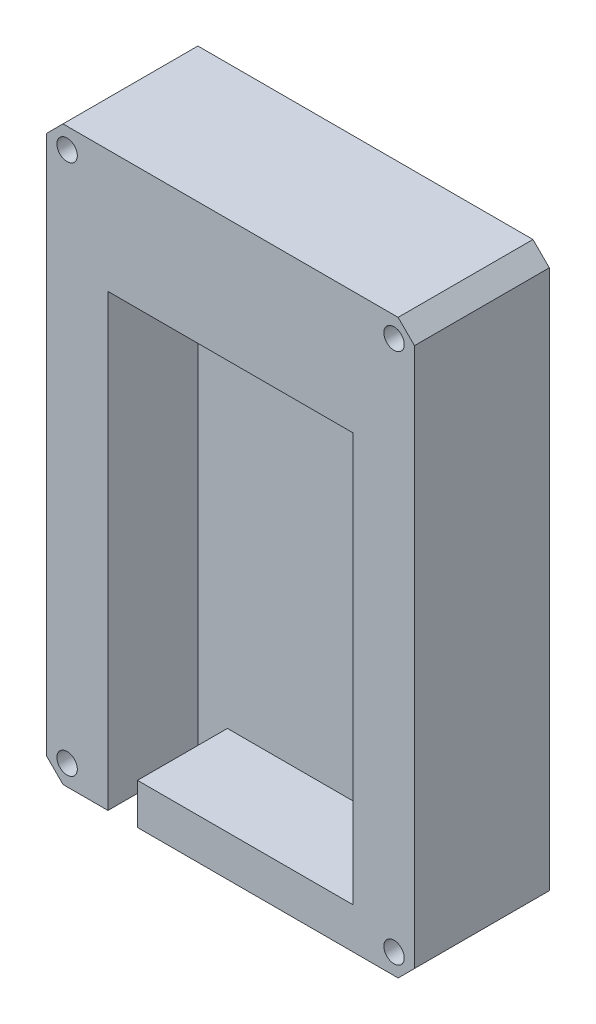
ISO-10303-21;
HEADER;
FILE_DESCRIPTION(('STEP AP214'),'2;1');
FILE_NAME('part.step','',(''),(''),'','','');
FILE_SCHEMA(('AUTOMOTIVE_DESIGN { 1 0 10303 214 1 1 1 1 }'));
ENDSEC;
DATA;
#1=APPLICATION_CONTEXT('core data for automotive mechanical design processes');
#2=APPLICATION_PROTOCOL_DEFINITION('international standard','automotive_design',2000,#1);
#3=PRODUCT_CONTEXT('',#1,'mechanical');
#4=PRODUCT('Part','Part','',(#3));
#5=PRODUCT_RELATED_PRODUCT_CATEGORY('part','',(#4));
#6=PRODUCT_DEFINITION_FORMATION('','',#4);
#7=PRODUCT_DEFINITION_CONTEXT('part definition',#1,'design');
#8=PRODUCT_DEFINITION('design','',#6,#7);
#9=PRODUCT_DEFINITION_SHAPE('','',#8);
#10=(LENGTH_UNIT() NAMED_UNIT(*) SI_UNIT(.MILLI.,.METRE.));
#11=(NAMED_UNIT(*) PLANE_ANGLE_UNIT() SI_UNIT($,.RADIAN.));
#12=(NAMED_UNIT(*) SI_UNIT($,.STERADIAN.) SOLID_ANGLE_UNIT());
#13=UNCERTAINTY_MEASURE_WITH_UNIT(LENGTH_MEASURE(1.E-05),#10,'distance_accuracy_value','');
#14=(GEOMETRIC_REPRESENTATION_CONTEXT(3) GLOBAL_UNCERTAINTY_ASSIGNED_CONTEXT((#13)) GLOBAL_UNIT_ASSIGNED_CONTEXT((#10,
#11,#12)) REPRESENTATION_CONTEXT('',''));
#15=CARTESIAN_POINT('',(0.,0.,0.));
#16=DIRECTION('',(0.,0.,1.));
#17=DIRECTION('',(1.,0.,0.));
#18=AXIS2_PLACEMENT_3D('',#15,#16,#17);
#19=CARTESIAN_POINT('',(0.,0.,-5.5));
#20=DIRECTION('',(0.,0.,1.));
#21=DIRECTION('',(1.,0.,0.));
#22=AXIS2_PLACEMENT_3D('',#19,#20,#21);
#23=PLANE('',#22);
#24=CARTESIAN_POINT('',(-20.,32.5,-5.5));
#25=DIRECTION('',(0.,0.,-1.));
#26=DIRECTION('',(-1.,0.,0.));
#27=AXIS2_PLACEMENT_3D('',#24,#25,#26);
#28=CIRCLE('',#27,1.275);
#29=CARTESIAN_POINT('',(-21.275,32.5,-5.5));
#30=VERTEX_POINT('',#29);
#31=EDGE_CURVE('E312',#30,#30,#28,.T.);
#32=ORIENTED_EDGE('',*,*,#31,.F.);
#33=EDGE_LOOP('',(#32));
#34=FACE_BOUND('',#33,.T.);
#35=CARTESIAN_POINT('',(20.,32.5,-5.5));
#36=DIRECTION('',(0.,0.,-1.));
#37=DIRECTION('',(-1.,0.,0.));
#38=AXIS2_PLACEMENT_3D('',#35,#36,#37);
#39=CIRCLE('',#38,1.275);
#40=CARTESIAN_POINT('',(18.725,32.5,-5.5));
#41=VERTEX_POINT('',#40);
#42=EDGE_CURVE('E303',#41,#41,#39,.T.);
#43=ORIENTED_EDGE('',*,*,#42,.F.);
#44=EDGE_LOOP('',(#43));
#45=FACE_BOUND('',#44,.T.);
#46=CARTESIAN_POINT('',(-20.,-32.5,-5.5));
#47=DIRECTION('',(0.,0.,-1.));
#48=DIRECTION('',(-1.,0.,0.));
#49=AXIS2_PLACEMENT_3D('',#46,#47,#48);
#50=CIRCLE('',#49,1.275);
#51=CARTESIAN_POINT('',(-21.275,-32.5,-5.5));
#52=VERTEX_POINT('',#51);
#53=EDGE_CURVE('E285',#52,#52,#50,.T.);
#54=ORIENTED_EDGE('',*,*,#53,.F.);
#55=EDGE_LOOP('',(#54));
#56=FACE_BOUND('',#55,.T.);
#57=DIRECTION('',(0.,1.,0.));
#58=VECTOR('',#57,1.);
#59=CARTESIAN_POINT('',(22.5,0.,-5.5));
#60=LINE('',#59,#58);
#61=CARTESIAN_POINT('',(22.5,-33.,-5.5));
#62=VERTEX_POINT('',#61);
#63=CARTESIAN_POINT('',(22.5,33.,-5.5));
#64=VERTEX_POINT('',#63);
#65=EDGE_CURVE('E228',#62,#64,#60,.T.);
#66=ORIENTED_EDGE('',*,*,#65,.F.);
#67=DIRECTION('',(0.707106781186549,0.707106781186546,0.));
#68=VECTOR('',#67,1.);
#69=CARTESIAN_POINT('',(22.5,-33.,-5.5));
#70=LINE('',#69,#68);
#71=CARTESIAN_POINT('',(20.5,-35.,-5.5));
#72=VERTEX_POINT('',#71);
#73=EDGE_CURVE('E193',#62,#72,#70,.F.);
#74=ORIENTED_EDGE('',*,*,#73,.T.);
#75=DIRECTION('',(1.,0.,0.));
#76=VECTOR('',#75,1.);
#77=CARTESIAN_POINT('',(0.,-35.,-5.5));
#78=LINE('',#77,#76);
#79=CARTESIAN_POINT('',(-20.5,-35.,-5.5));
#80=VERTEX_POINT('',#79);
#81=EDGE_CURVE('E231',#80,#72,#78,.T.);
#82=ORIENTED_EDGE('',*,*,#81,.F.);
#83=DIRECTION('',(-0.707106781186546,0.707106781186549,0.));
#84=VECTOR('',#83,1.);
#85=CARTESIAN_POINT('',(-20.5,-35.,-5.5));
#86=LINE('',#85,#84);
#87=CARTESIAN_POINT('',(-22.5,-33.,-5.5));
#88=VERTEX_POINT('',#87);
#89=EDGE_CURVE('E187',#80,#88,#86,.T.);
#90=ORIENTED_EDGE('',*,*,#89,.T.);
#91=DIRECTION('',(0.,1.,0.));
#92=VECTOR('',#91,1.);
#93=CARTESIAN_POINT('',(-22.5,0.,-5.5));
#94=LINE('',#93,#92);
#95=CARTESIAN_POINT('',(-22.5,33.,-5.5));
#96=VERTEX_POINT('',#95);
#97=EDGE_CURVE('E166',#88,#96,#94,.T.);
#98=ORIENTED_EDGE('',*,*,#97,.T.);
#99=DIRECTION('',(-0.70710678118655,-0.707106781186545,0.));
#100=VECTOR('',#99,1.);
#101=CARTESIAN_POINT('',(-22.5,33.,-5.5));
#102=LINE('',#101,#100);
#103=CARTESIAN_POINT('',(-20.5,35.,-5.5));
#104=VERTEX_POINT('',#103);
#105=EDGE_CURVE('E189',#96,#104,#102,.F.);
#106=ORIENTED_EDGE('',*,*,#105,.T.);
#107=DIRECTION('',(1.,0.,0.));
#108=VECTOR('',#107,1.);
#109=CARTESIAN_POINT('',(0.,35.,-5.5));
#110=LINE('',#109,#108);
#111=CARTESIAN_POINT('',(20.5,35.,-5.5));
#112=VERTEX_POINT('',#111);
#113=EDGE_CURVE('E217',#104,#112,#110,.T.);
#114=ORIENTED_EDGE('',*,*,#113,.T.);
#115=DIRECTION('',(0.707106781186546,-0.707106781186549,0.));
#116=VECTOR('',#115,1.);
#117=CARTESIAN_POINT('',(20.5,35.,-5.5));
#118=LINE('',#117,#116);
#119=EDGE_CURVE('E191',#112,#64,#118,.T.);
#120=ORIENTED_EDGE('',*,*,#119,.T.);
#121=EDGE_LOOP('',(#66,#74,#82,#90,#98,#106,#114,#120));
#122=FACE_BOUND('',#121,.T.);
#123=CARTESIAN_POINT('',(20.,-32.5,-5.5));
#124=DIRECTION('',(0.,0.,-1.));
#125=DIRECTION('',(-1.,0.,0.));
#126=AXIS2_PLACEMENT_3D('',#123,#124,#125);
#127=CIRCLE('',#126,1.275);
#128=CARTESIAN_POINT('',(18.725,-32.5,-5.5));
#129=VERTEX_POINT('',#128);
#130=EDGE_CURVE('E294',#129,#129,#127,.T.);
#131=ORIENTED_EDGE('',*,*,#130,.F.);
#132=EDGE_LOOP('',(#131));
#133=FACE_BOUND('',#132,.T.);
#134=ADVANCED_FACE('F41',(#34,#45,#56,#122,#133),#23,.F.);
#135=CARTESIAN_POINT('',(0.,-30.,11.));
#136=DIRECTION('',(0.,1.,0.));
#137=DIRECTION('',(-1.,0.,0.));
#138=AXIS2_PLACEMENT_3D('',#135,#136,#137);
#139=PLANE('',#138);
#140=DIRECTION('',(1.,0.,0.));
#141=VECTOR('',#140,1.);
#142=CARTESIAN_POINT('',(0.,-30.,0.));
#143=LINE('',#142,#141);
#144=CARTESIAN_POINT('',(-11.3884900725321,-30.,0.));
#145=VERTEX_POINT('',#144);
#146=CARTESIAN_POINT('',(15.,-30.,0.));
#147=VERTEX_POINT('',#146);
#148=EDGE_CURVE('E227',#145,#147,#143,.T.);
#149=ORIENTED_EDGE('',*,*,#148,.F.);
#150=DIRECTION('',(0.,0.,-1.));
#151=VECTOR('',#150,1.);
#152=CARTESIAN_POINT('',(-11.3884900725321,-30.,11.));
#153=LINE('',#152,#151);
#154=CARTESIAN_POINT('',(-11.3884900725321,-30.,11.));
#155=VERTEX_POINT('',#154);
#156=EDGE_CURVE('E174',#155,#145,#153,.T.);
#157=ORIENTED_EDGE('',*,*,#156,.F.);
#158=DIRECTION('',(1.,0.,0.));
#159=VECTOR('',#158,1.);
#160=CARTESIAN_POINT('',(0.,-30.,11.));
#161=LINE('',#160,#159);
#162=CARTESIAN_POINT('',(15.,-30.,11.));
#163=VERTEX_POINT('',#162);
#164=EDGE_CURVE('E235',#155,#163,#161,.T.);
#165=ORIENTED_EDGE('',*,*,#164,.T.);
#166=DIRECTION('',(0.,0.,-1.));
#167=VECTOR('',#166,1.);
#168=CARTESIAN_POINT('',(15.,-30.,11.));
#169=LINE('',#168,#167);
#170=EDGE_CURVE('E256',#163,#147,#169,.T.);
#171=ORIENTED_EDGE('',*,*,#170,.T.);
#172=EDGE_LOOP('',(#149,#157,#165,#171));
#173=FACE_BOUND('',#172,.T.);
#174=ADVANCED_FACE('F320',(#173),#139,.T.);
#175=CARTESIAN_POINT('',(-11.3884900725321,0.,11.));
#176=DIRECTION('',(1.,0.,0.));
#177=DIRECTION('',(0.,1.,0.));
#178=AXIS2_PLACEMENT_3D('',#175,#176,#177);
#179=PLANE('',#178);
#180=DIRECTION('',(0.,-1.,0.));
#181=VECTOR('',#180,1.);
#182=CARTESIAN_POINT('',(-11.3884900725321,0.,0.));
#183=LINE('',#182,#181);
#184=CARTESIAN_POINT('',(-11.3884900725321,-35.,0.));
#185=VERTEX_POINT('',#184);
#186=EDGE_CURVE('E153',#145,#185,#183,.T.);
#187=ORIENTED_EDGE('',*,*,#186,.T.);
#188=DIRECTION('',(0.,0.,-1.));
#189=VECTOR('',#188,1.);
#190=CARTESIAN_POINT('',(-11.3884900725321,-35.,11.));
#191=LINE('',#190,#189);
#192=CARTESIAN_POINT('',(-11.3884900725321,-35.,11.));
#193=VERTEX_POINT('',#192);
#194=EDGE_CURVE('E165',#193,#185,#191,.T.);
#195=ORIENTED_EDGE('',*,*,#194,.F.);
#196=DIRECTION('',(0.,-1.,0.));
#197=VECTOR('',#196,1.);
#198=CARTESIAN_POINT('',(-11.3884900725321,0.,11.));
#199=LINE('',#198,#197);
#200=EDGE_CURVE('E238',#155,#193,#199,.T.);
#201=ORIENTED_EDGE('',*,*,#200,.F.);
#202=ORIENTED_EDGE('',*,*,#156,.T.);
#203=EDGE_LOOP('',(#187,#195,#201,#202));
#204=FACE_BOUND('',#203,.T.);
#205=ADVANCED_FACE('F364',(#204),#179,.F.);
#206=CARTESIAN_POINT('',(22.5,0.,11.));
#207=DIRECTION('',(-1.,0.,0.));
#208=DIRECTION('',(0.,-1.,0.));
#209=AXIS2_PLACEMENT_3D('',#206,#207,#208);
#210=PLANE('',#209);
#211=DIRECTION('',(0.,1.,0.));
#212=VECTOR('',#211,1.);
#213=CARTESIAN_POINT('',(22.5,0.,11.));
#214=LINE('',#213,#212);
#215=CARTESIAN_POINT('',(22.5,-33.,11.));
#216=VERTEX_POINT('',#215);
#217=CARTESIAN_POINT('',(22.5,33.,11.));
#218=VERTEX_POINT('',#217);
#219=EDGE_CURVE('E244',#216,#218,#214,.T.);
#220=ORIENTED_EDGE('',*,*,#219,.F.);
#221=DIRECTION('',(0.,0.,-1.));
#222=VECTOR('',#221,1.);
#223=CARTESIAN_POINT('',(22.5,-33.,11.));
#224=LINE('',#223,#222);
#225=EDGE_CURVE('E184',#216,#62,#224,.T.);
#226=ORIENTED_EDGE('',*,*,#225,.T.);
#227=ORIENTED_EDGE('',*,*,#65,.T.);
#228=DIRECTION('',(0.,0.,1.));
#229=VECTOR('',#228,1.);
#230=CARTESIAN_POINT('',(22.5,33.,11.));
#231=LINE('',#230,#229);
#232=EDGE_CURVE('E182',#64,#218,#231,.T.);
#233=ORIENTED_EDGE('',*,*,#232,.T.);
#234=EDGE_LOOP('',(#220,#226,#227,#233));
#235=FACE_BOUND('',#234,.T.);
#236=ADVANCED_FACE('F361',(#235),#210,.F.);
#237=CARTESIAN_POINT('',(0.,35.,11.));
#238=DIRECTION('',(0.,1.,0.));
#239=DIRECTION('',(-1.,0.,0.));
#240=AXIS2_PLACEMENT_3D('',#237,#238,#239);
#241=PLANE('',#240);
#242=DIRECTION('',(1.,0.,0.));
#243=VECTOR('',#242,1.);
#244=CARTESIAN_POINT('',(0.,35.,11.));
#245=LINE('',#244,#243);
#246=CARTESIAN_POINT('',(-20.5,35.,11.));
#247=VERTEX_POINT('',#246);
#248=CARTESIAN_POINT('',(20.5,35.,11.));
#249=VERTEX_POINT('',#248);
#250=EDGE_CURVE('E219',#247,#249,#245,.T.);
#251=ORIENTED_EDGE('',*,*,#250,.T.);
#252=DIRECTION('',(0.,0.,-1.));
#253=VECTOR('',#252,1.);
#254=CARTESIAN_POINT('',(20.5,35.,-5.5));
#255=LINE('',#254,#253);
#256=EDGE_CURVE('E209',#249,#112,#255,.T.);
#257=ORIENTED_EDGE('',*,*,#256,.T.);
#258=ORIENTED_EDGE('',*,*,#113,.F.);
#259=DIRECTION('',(0.,0.,1.));
#260=VECTOR('',#259,1.);
#261=CARTESIAN_POINT('',(-20.5,35.,11.));
#262=LINE('',#261,#260);
#263=EDGE_CURVE('E207',#104,#247,#262,.T.);
#264=ORIENTED_EDGE('',*,*,#263,.T.);
#265=EDGE_LOOP('',(#251,#257,#258,#264));
#266=FACE_BOUND('',#265,.T.);
#267=ADVANCED_FACE('F216',(#266),#241,.T.);
#268=CARTESIAN_POINT('',(-22.5,0.,11.));
#269=DIRECTION('',(-1.,0.,0.));
#270=DIRECTION('',(0.,0.,1.));
#271=AXIS2_PLACEMENT_3D('',#268,#269,#270);
#272=PLANE('',#271);
#273=DIRECTION('',(0.,1.,0.));
#274=VECTOR('',#273,1.);
#275=CARTESIAN_POINT('',(-22.5,0.,11.));
#276=LINE('',#275,#274);
#277=CARTESIAN_POINT('',(-22.5,-33.,11.));
#278=VERTEX_POINT('',#277);
#279=CARTESIAN_POINT('',(-22.5,33.,11.));
#280=VERTEX_POINT('',#279);
#281=EDGE_CURVE('E249',#278,#280,#276,.T.);
#282=ORIENTED_EDGE('',*,*,#281,.T.);
#283=DIRECTION('',(0.,0.,-1.));
#284=VECTOR('',#283,1.);
#285=CARTESIAN_POINT('',(-22.5,33.,11.));
#286=LINE('',#285,#284);
#287=EDGE_CURVE('E11',#280,#96,#286,.T.);
#288=ORIENTED_EDGE('',*,*,#287,.T.);
#289=ORIENTED_EDGE('',*,*,#97,.F.);
#290=DIRECTION('',(0.,0.,1.));
#291=VECTOR('',#290,1.);
#292=CARTESIAN_POINT('',(-22.5,-33.,11.));
#293=LINE('',#292,#291);
#294=EDGE_CURVE('E50',#88,#278,#293,.T.);
#295=ORIENTED_EDGE('',*,*,#294,.T.);
#296=EDGE_LOOP('',(#282,#288,#289,#295));
#297=FACE_BOUND('',#296,.T.);
#298=ADVANCED_FACE('F276',(#297),#272,.T.);
#299=CARTESIAN_POINT('',(0.,-35.,11.));
#300=DIRECTION('',(0.,1.,0.));
#301=DIRECTION('',(0.,0.,1.));
#302=AXIS2_PLACEMENT_3D('',#299,#300,#301);
#303=PLANE('',#302);
#304=ORIENTED_EDGE('',*,*,#81,.T.);
#305=DIRECTION('',(0.,0.,1.));
#306=VECTOR('',#305,1.);
#307=CARTESIAN_POINT('',(20.5,-35.,11.));
#308=LINE('',#307,#306);
#309=CARTESIAN_POINT('',(20.5,-35.,11.));
#310=VERTEX_POINT('',#309);
#311=EDGE_CURVE('E198',#72,#310,#308,.T.);
#312=ORIENTED_EDGE('',*,*,#311,.T.);
#313=DIRECTION('',(1.,0.,0.));
#314=VECTOR('',#313,1.);
#315=CARTESIAN_POINT('',(0.,-35.,11.));
#316=LINE('',#315,#314);
#317=EDGE_CURVE('E241',#193,#310,#316,.T.);
#318=ORIENTED_EDGE('',*,*,#317,.F.);
#319=ORIENTED_EDGE('',*,*,#194,.T.);
#320=DIRECTION('',(1.,0.,0.));
#321=VECTOR('',#320,1.);
#322=CARTESIAN_POINT('',(0.,-35.,0.));
#323=LINE('',#322,#321);
#324=CARTESIAN_POINT('',(-15.,-35.,0.));
#325=VERTEX_POINT('',#324);
#326=EDGE_CURVE('E146',#325,#185,#323,.T.);
#327=ORIENTED_EDGE('',*,*,#326,.F.);
#328=DIRECTION('',(0.,0.,-1.));
#329=VECTOR('',#328,1.);
#330=CARTESIAN_POINT('',(-15.,-35.,11.));
#331=LINE('',#330,#329);
#332=CARTESIAN_POINT('',(-15.,-35.,11.));
#333=VERTEX_POINT('',#332);
#334=EDGE_CURVE('E161',#333,#325,#331,.T.);
#335=ORIENTED_EDGE('',*,*,#334,.F.);
#336=CARTESIAN_POINT('',(-20.5,-35.,11.));
#337=VERTEX_POINT('',#336);
#338=EDGE_CURVE('E245',#337,#333,#316,.T.);
#339=ORIENTED_EDGE('',*,*,#338,.F.);
#340=DIRECTION('',(0.,0.,-1.));
#341=VECTOR('',#340,1.);
#342=CARTESIAN_POINT('',(-20.5,-35.,-5.5));
#343=LINE('',#342,#341);
#344=EDGE_CURVE('E195',#337,#80,#343,.T.);
#345=ORIENTED_EDGE('',*,*,#344,.T.);
#346=EDGE_LOOP('',(#304,#312,#318,#319,#327,#335,#339,#345));
#347=FACE_BOUND('',#346,.T.);
#348=ADVANCED_FACE('F159',(#347),#303,.F.);
#349=CARTESIAN_POINT('',(-15.,0.,11.));
#350=DIRECTION('',(1.,0.,0.));
#351=DIRECTION('',(0.,0.,-1.));
#352=AXIS2_PLACEMENT_3D('',#349,#350,#351);
#353=PLANE('',#352);
#354=DIRECTION('',(0.,-1.,0.));
#355=VECTOR('',#354,1.);
#356=CARTESIAN_POINT('',(-15.,0.,0.));
#357=LINE('',#356,#355);
#358=CARTESIAN_POINT('',(-15.,20.,0.));
#359=VERTEX_POINT('',#358);
#360=EDGE_CURVE('E143',#359,#325,#357,.T.);
#361=ORIENTED_EDGE('',*,*,#360,.F.);
#362=DIRECTION('',(0.,0.,-1.));
#363=VECTOR('',#362,1.);
#364=CARTESIAN_POINT('',(-15.,20.,11.));
#365=LINE('',#364,#363);
#366=CARTESIAN_POINT('',(-15.,20.,11.));
#367=VERTEX_POINT('',#366);
#368=EDGE_CURVE('E172',#367,#359,#365,.T.);
#369=ORIENTED_EDGE('',*,*,#368,.F.);
#370=DIRECTION('',(0.,-1.,0.));
#371=VECTOR('',#370,1.);
#372=CARTESIAN_POINT('',(-15.,0.,11.));
#373=LINE('',#372,#371);
#374=EDGE_CURVE('E171',#367,#333,#373,.T.);
#375=ORIENTED_EDGE('',*,*,#374,.T.);
#376=ORIENTED_EDGE('',*,*,#334,.T.);
#377=EDGE_LOOP('',(#361,#369,#375,#376));
#378=FACE_BOUND('',#377,.T.);
#379=ADVANCED_FACE('F169',(#378),#353,.T.);
#380=CARTESIAN_POINT('',(0.,20.,11.));
#381=DIRECTION('',(0.,1.,0.));
#382=DIRECTION('',(-1.,0.,0.));
#383=AXIS2_PLACEMENT_3D('',#380,#381,#382);
#384=PLANE('',#383);
#385=DIRECTION('',(1.,0.,0.));
#386=VECTOR('',#385,1.);
#387=CARTESIAN_POINT('',(0.,20.,0.));
#388=LINE('',#387,#386);
#389=CARTESIAN_POINT('',(15.,20.,0.));
#390=VERTEX_POINT('',#389);
#391=EDGE_CURVE('E149',#359,#390,#388,.T.);
#392=ORIENTED_EDGE('',*,*,#391,.T.);
#393=DIRECTION('',(0.,0.,-1.));
#394=VECTOR('',#393,1.);
#395=CARTESIAN_POINT('',(15.,20.,11.));
#396=LINE('',#395,#394);
#397=CARTESIAN_POINT('',(15.,20.,11.));
#398=VERTEX_POINT('',#397);
#399=EDGE_CURVE('E176',#398,#390,#396,.T.);
#400=ORIENTED_EDGE('',*,*,#399,.F.);
#401=DIRECTION('',(1.,0.,0.));
#402=VECTOR('',#401,1.);
#403=CARTESIAN_POINT('',(0.,20.,11.));
#404=LINE('',#403,#402);
#405=EDGE_CURVE('E252',#367,#398,#404,.T.);
#406=ORIENTED_EDGE('',*,*,#405,.F.);
#407=ORIENTED_EDGE('',*,*,#368,.T.);
#408=EDGE_LOOP('',(#392,#400,#406,#407));
#409=FACE_BOUND('',#408,.T.);
#410=ADVANCED_FACE('F270',(#409),#384,.F.);
#411=CARTESIAN_POINT('',(15.,0.,11.));
#412=DIRECTION('',(-1.,0.,0.));
#413=DIRECTION('',(0.,-1.,0.));
#414=AXIS2_PLACEMENT_3D('',#411,#412,#413);
#415=PLANE('',#414);
#416=DIRECTION('',(0.,1.,0.));
#417=VECTOR('',#416,1.);
#418=CARTESIAN_POINT('',(15.,0.,0.));
#419=LINE('',#418,#417);
#420=EDGE_CURVE('E239',#147,#390,#419,.T.);
#421=ORIENTED_EDGE('',*,*,#420,.F.);
#422=ORIENTED_EDGE('',*,*,#170,.F.);
#423=DIRECTION('',(0.,1.,0.));
#424=VECTOR('',#423,1.);
#425=CARTESIAN_POINT('',(15.,0.,11.));
#426=LINE('',#425,#424);
#427=EDGE_CURVE('E254',#163,#398,#426,.T.);
#428=ORIENTED_EDGE('',*,*,#427,.T.);
#429=ORIENTED_EDGE('',*,*,#399,.T.);
#430=EDGE_LOOP('',(#421,#422,#428,#429));
#431=FACE_BOUND('',#430,.T.);
#432=ADVANCED_FACE('F266',(#431),#415,.T.);
#433=CARTESIAN_POINT('',(0.,0.,11.));
#434=DIRECTION('',(0.,0.,1.));
#435=DIRECTION('',(1.,0.,0.));
#436=AXIS2_PLACEMENT_3D('',#433,#434,#435);
#437=PLANE('',#436);
#438=CARTESIAN_POINT('',(-20.,32.5,11.));
#439=DIRECTION('',(0.,0.,-1.));
#440=DIRECTION('',(-1.,0.,0.));
#441=AXIS2_PLACEMENT_3D('',#438,#439,#440);
#442=CIRCLE('',#441,1.25);
#443=CARTESIAN_POINT('',(-21.25,32.5,11.));
#444=VERTEX_POINT('',#443);
#445=EDGE_CURVE('E306',#444,#444,#442,.T.);
#446=ORIENTED_EDGE('',*,*,#445,.T.);
#447=EDGE_LOOP('',(#446));
#448=FACE_BOUND('',#447,.T.);
#449=CARTESIAN_POINT('',(20.,32.5,11.));
#450=DIRECTION('',(0.,0.,-1.));
#451=DIRECTION('',(-1.,0.,0.));
#452=AXIS2_PLACEMENT_3D('',#449,#450,#451);
#453=CIRCLE('',#452,1.25);
#454=CARTESIAN_POINT('',(18.75,32.5,11.));
#455=VERTEX_POINT('',#454);
#456=EDGE_CURVE('E297',#455,#455,#453,.T.);
#457=ORIENTED_EDGE('',*,*,#456,.T.);
#458=EDGE_LOOP('',(#457));
#459=FACE_BOUND('',#458,.T.);
#460=CARTESIAN_POINT('',(20.,-32.5,11.));
#461=DIRECTION('',(0.,0.,-1.));
#462=DIRECTION('',(-1.,0.,0.));
#463=AXIS2_PLACEMENT_3D('',#460,#461,#462);
#464=CIRCLE('',#463,1.25);
#465=CARTESIAN_POINT('',(18.75,-32.5,11.));
#466=VERTEX_POINT('',#465);
#467=EDGE_CURVE('E288',#466,#466,#464,.T.);
#468=ORIENTED_EDGE('',*,*,#467,.T.);
#469=EDGE_LOOP('',(#468));
#470=FACE_BOUND('',#469,.T.);
#471=CARTESIAN_POINT('',(-20.,-32.5,11.));
#472=DIRECTION('',(0.,0.,-1.));
#473=DIRECTION('',(-1.,0.,0.));
#474=AXIS2_PLACEMENT_3D('',#471,#472,#473);
#475=CIRCLE('',#474,1.25);
#476=CARTESIAN_POINT('',(-21.25,-32.5,11.));
#477=VERTEX_POINT('',#476);
#478=EDGE_CURVE('E167',#477,#477,#475,.T.);
#479=ORIENTED_EDGE('',*,*,#478,.T.);
#480=EDGE_LOOP('',(#479));
#481=FACE_BOUND('',#480,.T.);
#482=ORIENTED_EDGE('',*,*,#317,.T.);
#483=DIRECTION('',(-0.707106781186549,-0.707106781186546,0.));
#484=VECTOR('',#483,1.);
#485=CARTESIAN_POINT('',(27.7499999999999,-27.75,11.));
#486=LINE('',#485,#484);
#487=EDGE_CURVE('E205',#310,#216,#486,.F.);
#488=ORIENTED_EDGE('',*,*,#487,.T.);
#489=ORIENTED_EDGE('',*,*,#219,.T.);
#490=DIRECTION('',(-0.707106781186546,0.707106781186549,0.));
#491=VECTOR('',#490,1.);
#492=CARTESIAN_POINT('',(27.75,27.7499999999999,11.));
#493=LINE('',#492,#491);
#494=EDGE_CURVE('E203',#218,#249,#493,.T.);
#495=ORIENTED_EDGE('',*,*,#494,.T.);
#496=ORIENTED_EDGE('',*,*,#250,.F.);
#497=DIRECTION('',(0.70710678118655,0.707106781186545,0.));
#498=VECTOR('',#497,1.);
#499=CARTESIAN_POINT('',(-27.7499999999999,27.7500000000001,11.));
#500=LINE('',#499,#498);
#501=EDGE_CURVE('E57',#247,#280,#500,.F.);
#502=ORIENTED_EDGE('',*,*,#501,.T.);
#503=ORIENTED_EDGE('',*,*,#281,.F.);
#504=DIRECTION('',(0.707106781186546,-0.707106781186549,0.));
#505=VECTOR('',#504,1.);
#506=CARTESIAN_POINT('',(-27.75,-27.7499999999999,11.));
#507=LINE('',#506,#505);
#508=EDGE_CURVE('E200',#278,#337,#507,.T.);
#509=ORIENTED_EDGE('',*,*,#508,.T.);
#510=ORIENTED_EDGE('',*,*,#338,.T.);
#511=ORIENTED_EDGE('',*,*,#374,.F.);
#512=ORIENTED_EDGE('',*,*,#405,.T.);
#513=ORIENTED_EDGE('',*,*,#427,.F.);
#514=ORIENTED_EDGE('',*,*,#164,.F.);
#515=ORIENTED_EDGE('',*,*,#200,.T.);
#516=EDGE_LOOP('',(#482,#488,#489,#495,#496,#502,#503,#509,#510,#511,#512,#513,#514,#515));
#517=FACE_BOUND('',#516,.T.);
#518=ADVANCED_FACE('F271',(#448,#459,#470,#481,#517),#437,.T.);
#519=CARTESIAN_POINT('',(0.,0.,0.));
#520=DIRECTION('',(0.,0.,1.));
#521=DIRECTION('',(1.,0.,0.));
#522=AXIS2_PLACEMENT_3D('',#519,#520,#521);
#523=PLANE('',#522);
#524=ORIENTED_EDGE('',*,*,#391,.F.);
#525=ORIENTED_EDGE('',*,*,#360,.T.);
#526=ORIENTED_EDGE('',*,*,#326,.T.);
#527=ORIENTED_EDGE('',*,*,#186,.F.);
#528=ORIENTED_EDGE('',*,*,#148,.T.);
#529=ORIENTED_EDGE('',*,*,#420,.T.);
#530=EDGE_LOOP('',(#524,#525,#526,#527,#528,#529));
#531=FACE_BOUND('',#530,.T.);
#532=ADVANCED_FACE('F145',(#531),#523,.T.);
#533=CARTESIAN_POINT('',(-20.,-32.5,-5.5));
#534=DIRECTION('',(0.,0.,-1.));
#535=DIRECTION('',(-1.,0.,0.));
#536=AXIS2_PLACEMENT_3D('',#533,#534,#535);
#537=CYLINDRICAL_SURFACE('',#536,1.25);
#538=ORIENTED_EDGE('',*,*,#478,.F.);
#539=EDGE_LOOP('',(#538));
#540=FACE_BOUND('',#539,.T.);
#541=CARTESIAN_POINT('',(-20.,-32.5,-5.475));
#542=DIRECTION('',(0.,0.,-1.));
#543=DIRECTION('',(-1.,0.,0.));
#544=AXIS2_PLACEMENT_3D('',#541,#542,#543);
#545=CIRCLE('',#544,1.25);
#546=CARTESIAN_POINT('',(-21.25,-32.5,-5.475));
#547=VERTEX_POINT('',#546);
#548=EDGE_CURVE('E282',#547,#547,#545,.T.);
#549=ORIENTED_EDGE('',*,*,#548,.T.);
#550=EDGE_LOOP('',(#549));
#551=FACE_BOUND('',#550,.T.);
#552=ADVANCED_FACE('F329',(#540,#551),#537,.F.);
#553=CARTESIAN_POINT('',(-20.,-32.5,-5.5));
#554=DIRECTION('',(0.,0.,-1.));
#555=DIRECTION('',(-1.,0.,0.));
#556=AXIS2_PLACEMENT_3D('',#553,#554,#555);
#557=CONICAL_SURFACE('',#556,1.275,0.785398163397414);
#558=ORIENTED_EDGE('',*,*,#548,.F.);
#559=EDGE_LOOP('',(#558));
#560=FACE_BOUND('',#559,.T.);
#561=ORIENTED_EDGE('',*,*,#53,.T.);
#562=EDGE_LOOP('',(#561));
#563=FACE_BOUND('',#562,.T.);
#564=ADVANCED_FACE('F326',(#560,#563),#557,.F.);
#565=CARTESIAN_POINT('',(20.,-32.5,-5.5));
#566=DIRECTION('',(0.,0.,-1.));
#567=DIRECTION('',(-1.,0.,0.));
#568=AXIS2_PLACEMENT_3D('',#565,#566,#567);
#569=CYLINDRICAL_SURFACE('',#568,1.25);
#570=ORIENTED_EDGE('',*,*,#467,.F.);
#571=EDGE_LOOP('',(#570));
#572=FACE_BOUND('',#571,.T.);
#573=CARTESIAN_POINT('',(20.,-32.5,-5.475));
#574=DIRECTION('',(0.,0.,-1.));
#575=DIRECTION('',(-1.,0.,0.));
#576=AXIS2_PLACEMENT_3D('',#573,#574,#575);
#577=CIRCLE('',#576,1.25);
#578=CARTESIAN_POINT('',(18.75,-32.5,-5.475));
#579=VERTEX_POINT('',#578);
#580=EDGE_CURVE('E291',#579,#579,#577,.T.);
#581=ORIENTED_EDGE('',*,*,#580,.T.);
#582=EDGE_LOOP('',(#581));
#583=FACE_BOUND('',#582,.T.);
#584=ADVANCED_FACE('F328',(#572,#583),#569,.F.);
#585=CARTESIAN_POINT('',(20.,-32.5,-5.5));
#586=DIRECTION('',(0.,0.,-1.));
#587=DIRECTION('',(-1.,0.,0.));
#588=AXIS2_PLACEMENT_3D('',#585,#586,#587);
#589=CONICAL_SURFACE('',#588,1.275,0.785398163397483);
#590=ORIENTED_EDGE('',*,*,#580,.F.);
#591=EDGE_LOOP('',(#590));
#592=FACE_BOUND('',#591,.T.);
#593=ORIENTED_EDGE('',*,*,#130,.T.);
#594=EDGE_LOOP('',(#593));
#595=FACE_BOUND('',#594,.T.);
#596=ADVANCED_FACE('F336',(#592,#595),#589,.F.);
#597=CARTESIAN_POINT('',(20.,32.5,-5.5));
#598=DIRECTION('',(0.,0.,-1.));
#599=DIRECTION('',(-1.,0.,0.));
#600=AXIS2_PLACEMENT_3D('',#597,#598,#599);
#601=CYLINDRICAL_SURFACE('',#600,1.25);
#602=ORIENTED_EDGE('',*,*,#456,.F.);
#603=EDGE_LOOP('',(#602));
#604=FACE_BOUND('',#603,.T.);
#605=CARTESIAN_POINT('',(20.,32.5,-5.475));
#606=DIRECTION('',(0.,0.,-1.));
#607=DIRECTION('',(-1.,0.,0.));
#608=AXIS2_PLACEMENT_3D('',#605,#606,#607);
#609=CIRCLE('',#608,1.25);
#610=CARTESIAN_POINT('',(18.75,32.5,-5.475));
#611=VERTEX_POINT('',#610);
#612=EDGE_CURVE('E300',#611,#611,#609,.T.);
#613=ORIENTED_EDGE('',*,*,#612,.T.);
#614=EDGE_LOOP('',(#613));
#615=FACE_BOUND('',#614,.T.);
#616=ADVANCED_FACE('F499',(#604,#615),#601,.F.);
#617=CARTESIAN_POINT('',(20.,32.5,-5.5));
#618=DIRECTION('',(0.,0.,-1.));
#619=DIRECTION('',(-1.,0.,0.));
#620=AXIS2_PLACEMENT_3D('',#617,#618,#619);
#621=CONICAL_SURFACE('',#620,1.275,0.785398163397414);
#622=ORIENTED_EDGE('',*,*,#612,.F.);
#623=EDGE_LOOP('',(#622));
#624=FACE_BOUND('',#623,.T.);
#625=ORIENTED_EDGE('',*,*,#42,.T.);
#626=EDGE_LOOP('',(#625));
#627=FACE_BOUND('',#626,.T.);
#628=ADVANCED_FACE('F488',(#624,#627),#621,.F.);
#629=CARTESIAN_POINT('',(-20.,32.5,-5.5));
#630=DIRECTION('',(0.,0.,-1.));
#631=DIRECTION('',(-1.,0.,0.));
#632=AXIS2_PLACEMENT_3D('',#629,#630,#631);
#633=CYLINDRICAL_SURFACE('',#632,1.25);
#634=ORIENTED_EDGE('',*,*,#445,.F.);
#635=EDGE_LOOP('',(#634));
#636=FACE_BOUND('',#635,.T.);
#637=CARTESIAN_POINT('',(-20.,32.5,-5.475));
#638=DIRECTION('',(0.,0.,-1.));
#639=DIRECTION('',(-1.,0.,0.));
#640=AXIS2_PLACEMENT_3D('',#637,#638,#639);
#641=CIRCLE('',#640,1.25);
#642=CARTESIAN_POINT('',(-21.25,32.5,-5.475));
#643=VERTEX_POINT('',#642);
#644=EDGE_CURVE('E309',#643,#643,#641,.T.);
#645=ORIENTED_EDGE('',*,*,#644,.T.);
#646=EDGE_LOOP('',(#645));
#647=FACE_BOUND('',#646,.T.);
#648=ADVANCED_FACE('F477',(#636,#647),#633,.F.);
#649=CARTESIAN_POINT('',(-20.,32.5,-5.5));
#650=DIRECTION('',(0.,0.,-1.));
#651=DIRECTION('',(-1.,0.,0.));
#652=AXIS2_PLACEMENT_3D('',#649,#650,#651);
#653=CONICAL_SURFACE('',#652,1.275,0.785398163397414);
#654=ORIENTED_EDGE('',*,*,#644,.F.);
#655=EDGE_LOOP('',(#654));
#656=FACE_BOUND('',#655,.T.);
#657=ORIENTED_EDGE('',*,*,#31,.T.);
#658=EDGE_LOOP('',(#657));
#659=FACE_BOUND('',#658,.T.);
#660=ADVANCED_FACE('F316',(#656,#659),#653,.F.);
#661=CARTESIAN_POINT('',(22.5,-33.,11.));
#662=DIRECTION('',(-0.707106781186546,0.707106781186549,0.));
#663=DIRECTION('',(0.,0.,-1.));
#664=AXIS2_PLACEMENT_3D('',#661,#662,#663);
#665=PLANE('',#664);
#666=ORIENTED_EDGE('',*,*,#487,.F.);
#667=ORIENTED_EDGE('',*,*,#311,.F.);
#668=ORIENTED_EDGE('',*,*,#73,.F.);
#669=ORIENTED_EDGE('',*,*,#225,.F.);
#670=EDGE_LOOP('',(#666,#667,#668,#669));
#671=FACE_BOUND('',#670,.T.);
#672=ADVANCED_FACE('F373',(#671),#665,.F.);
#673=CARTESIAN_POINT('',(20.5,35.,11.));
#674=DIRECTION('',(0.707106781186549,0.707106781186546,0.));
#675=DIRECTION('',(0.,0.,1.));
#676=AXIS2_PLACEMENT_3D('',#673,#674,#675);
#677=PLANE('',#676);
#678=ORIENTED_EDGE('',*,*,#494,.F.);
#679=ORIENTED_EDGE('',*,*,#232,.F.);
#680=ORIENTED_EDGE('',*,*,#119,.F.);
#681=ORIENTED_EDGE('',*,*,#256,.F.);
#682=EDGE_LOOP('',(#678,#679,#680,#681));
#683=FACE_BOUND('',#682,.T.);
#684=ADVANCED_FACE('F379',(#683),#677,.T.);
#685=CARTESIAN_POINT('',(-22.5,33.,11.));
#686=DIRECTION('',(0.707106781186545,-0.70710678118655,0.));
#687=DIRECTION('',(0.,0.,-1.));
#688=AXIS2_PLACEMENT_3D('',#685,#686,#687);
#689=PLANE('',#688);
#690=ORIENTED_EDGE('',*,*,#501,.F.);
#691=ORIENTED_EDGE('',*,*,#263,.F.);
#692=ORIENTED_EDGE('',*,*,#105,.F.);
#693=ORIENTED_EDGE('',*,*,#287,.F.);
#694=EDGE_LOOP('',(#690,#691,#692,#693));
#695=FACE_BOUND('',#694,.T.);
#696=ADVANCED_FACE('F385',(#695),#689,.F.);
#697=CARTESIAN_POINT('',(-20.5,-35.,11.));
#698=DIRECTION('',(-0.707106781186549,-0.707106781186546,0.));
#699=DIRECTION('',(0.,0.,1.));
#700=AXIS2_PLACEMENT_3D('',#697,#698,#699);
#701=PLANE('',#700);
#702=ORIENTED_EDGE('',*,*,#508,.F.);
#703=ORIENTED_EDGE('',*,*,#294,.F.);
#704=ORIENTED_EDGE('',*,*,#89,.F.);
#705=ORIENTED_EDGE('',*,*,#344,.F.);
#706=EDGE_LOOP('',(#702,#703,#704,#705));
#707=FACE_BOUND('',#706,.T.);
#708=ADVANCED_FACE('F44',(#707),#701,.T.);
#709=CLOSED_SHELL('',(#134,#174,#205,#236,#267,#298,#348,#379,#410,#432,#518,#532,#552,#564,
#584,#596,#616,#628,#648,#660,#672,#684,#696,#708));
#710=MANIFOLD_SOLID_BREP('B2',#709);
#711=ADVANCED_BREP_SHAPE_REPRESENTATION('',(#18,#710),#14);
#712=SHAPE_DEFINITION_REPRESENTATION(#9,#711);
ENDSEC;
END-ISO-10303-21;
